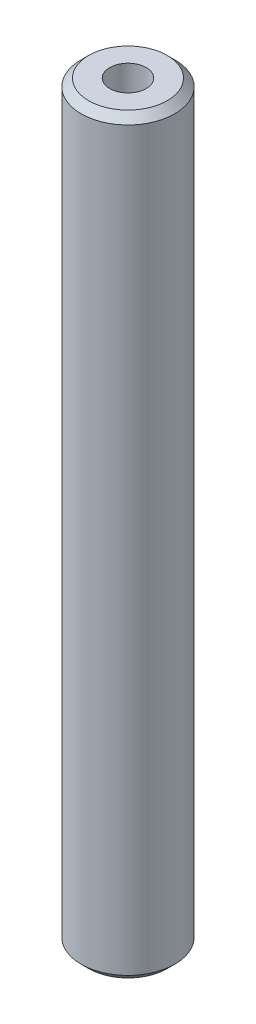
ISO-10303-21;
HEADER;
FILE_DESCRIPTION(('STEP AP214'),'2;1');
FILE_NAME('part.step','',(''),(''),'','','');
FILE_SCHEMA(('AUTOMOTIVE_DESIGN { 1 0 10303 214 1 1 1 1 }'));
ENDSEC;
DATA;
#1=APPLICATION_CONTEXT('core data for automotive mechanical design processes');
#2=APPLICATION_PROTOCOL_DEFINITION('international standard','automotive_design',2000,#1);
#3=PRODUCT_CONTEXT('',#1,'mechanical');
#4=PRODUCT('Part','Part','',(#3));
#5=PRODUCT_RELATED_PRODUCT_CATEGORY('part','',(#4));
#6=PRODUCT_DEFINITION_FORMATION('','',#4);
#7=PRODUCT_DEFINITION_CONTEXT('part definition',#1,'design');
#8=PRODUCT_DEFINITION('design','',#6,#7);
#9=PRODUCT_DEFINITION_SHAPE('','',#8);
#10=(LENGTH_UNIT() NAMED_UNIT(*) SI_UNIT(.MILLI.,.METRE.));
#11=(NAMED_UNIT(*) PLANE_ANGLE_UNIT() SI_UNIT($,.RADIAN.));
#12=(NAMED_UNIT(*) SI_UNIT($,.STERADIAN.) SOLID_ANGLE_UNIT());
#13=UNCERTAINTY_MEASURE_WITH_UNIT(LENGTH_MEASURE(1.E-05),#10,'distance_accuracy_value','');
#14=(GEOMETRIC_REPRESENTATION_CONTEXT(3) GLOBAL_UNCERTAINTY_ASSIGNED_CONTEXT((#13)) GLOBAL_UNIT_ASSIGNED_CONTEXT((#10,
#11,#12)) REPRESENTATION_CONTEXT('',''));
#15=CARTESIAN_POINT('',(0.,0.,0.));
#16=DIRECTION('',(0.,0.,1.));
#17=DIRECTION('',(1.,0.,0.));
#18=AXIS2_PLACEMENT_3D('',#15,#16,#17);
#19=CARTESIAN_POINT('',(0.,361.170907466975,0.));
#20=DIRECTION('',(0.,-1.,0.));
#21=DIRECTION('',(0.,0.,-1.));
#22=AXIS2_PLACEMENT_3D('',#19,#20,#21);
#23=CYLINDRICAL_SURFACE('',#22,22.5);
#24=CARTESIAN_POINT('',(0.,357.540232934624,0.));
#25=DIRECTION('',(0.,1.,0.));
#26=DIRECTION('',(0.,0.,1.));
#27=AXIS2_PLACEMENT_3D('',#24,#25,#26);
#28=CIRCLE('',#27,22.5);
#29=CARTESIAN_POINT('',(0.,357.540232934624,22.5));
#30=VERTEX_POINT('',#29);
#31=EDGE_CURVE('E50',#30,#30,#28,.F.);
#32=ORIENTED_EDGE('',*,*,#31,.T.);
#33=EDGE_LOOP('',(#32));
#34=FACE_BOUND('',#33,.T.);
#35=CARTESIAN_POINT('',(0.,3.63067453235028,0.));
#36=DIRECTION('',(0.,1.,0.));
#37=DIRECTION('',(0.,0.,1.));
#38=AXIS2_PLACEMENT_3D('',#35,#36,#37);
#39=CIRCLE('',#38,22.5);
#40=CARTESIAN_POINT('',(0.,3.63067453235028,22.5));
#41=VERTEX_POINT('',#40);
#42=EDGE_CURVE('E51',#41,#41,#39,.T.);
#43=ORIENTED_EDGE('',*,*,#42,.T.);
#44=EDGE_LOOP('',(#43));
#45=FACE_BOUND('',#44,.T.);
#46=ADVANCED_FACE('F39',(#34,#45),#23,.T.);
#47=CARTESIAN_POINT('',(0.,361.170907466975,0.));
#48=DIRECTION('',(0.,1.,0.));
#49=DIRECTION('',(0.,0.,1.));
#50=AXIS2_PLACEMENT_3D('',#47,#48,#49);
#51=PLANE('',#50);
#52=CARTESIAN_POINT('',(0.,361.170907466975,0.));
#53=DIRECTION('',(0.,1.,0.));
#54=DIRECTION('',(0.,0.,1.));
#55=AXIS2_PLACEMENT_3D('',#52,#53,#54);
#56=CIRCLE('',#55,18.8693254676497);
#57=CARTESIAN_POINT('',(0.,361.170907466975,18.8693254676497));
#58=VERTEX_POINT('',#57);
#59=EDGE_CURVE('E54',#58,#58,#56,.T.);
#60=ORIENTED_EDGE('',*,*,#59,.T.);
#61=EDGE_LOOP('',(#60));
#62=FACE_BOUND('',#61,.T.);
#63=CARTESIAN_POINT('',(0.,361.170907466975,0.));
#64=DIRECTION('',(0.,1.,0.));
#65=DIRECTION('',(0.,0.,1.));
#66=AXIS2_PLACEMENT_3D('',#63,#64,#65);
#67=CIRCLE('',#66,8.75318210047726);
#68=CARTESIAN_POINT('',(0.,361.170907466975,8.75318210047726));
#69=VERTEX_POINT('',#68);
#70=EDGE_CURVE('E58',#69,#69,#67,.T.);
#71=ORIENTED_EDGE('',*,*,#70,.F.);
#72=EDGE_LOOP('',(#71));
#73=FACE_BOUND('',#72,.T.);
#74=ADVANCED_FACE('F69',(#62,#73),#51,.T.);
#75=CARTESIAN_POINT('',(0.,0.,0.));
#76=DIRECTION('',(0.,1.,0.));
#77=DIRECTION('',(0.,0.,1.));
#78=AXIS2_PLACEMENT_3D('',#75,#76,#77);
#79=PLANE('',#78);
#80=CARTESIAN_POINT('',(0.,0.,0.));
#81=DIRECTION('',(0.,1.,0.));
#82=DIRECTION('',(0.,0.,1.));
#83=AXIS2_PLACEMENT_3D('',#80,#81,#82);
#84=CIRCLE('',#83,18.8693254676497);
#85=CARTESIAN_POINT('',(0.,0.,18.8693254676497));
#86=VERTEX_POINT('',#85);
#87=EDGE_CURVE('E10',#86,#86,#84,.F.);
#88=ORIENTED_EDGE('',*,*,#87,.T.);
#89=EDGE_LOOP('',(#88));
#90=FACE_BOUND('',#89,.T.);
#91=CARTESIAN_POINT('',(0.,0.,0.));
#92=DIRECTION('',(0.,1.,0.));
#93=DIRECTION('',(0.,0.,1.));
#94=AXIS2_PLACEMENT_3D('',#91,#92,#93);
#95=CIRCLE('',#94,8.75318210047726);
#96=CARTESIAN_POINT('',(0.,0.,8.75318210047726));
#97=VERTEX_POINT('',#96);
#98=EDGE_CURVE('E63',#97,#97,#95,.T.);
#99=ORIENTED_EDGE('',*,*,#98,.T.);
#100=EDGE_LOOP('',(#99));
#101=FACE_BOUND('',#100,.T.);
#102=ADVANCED_FACE('F75',(#90,#101),#79,.F.);
#103=CARTESIAN_POINT('',(0.,361.170907466975,0.));
#104=DIRECTION('',(0.,-1.,0.));
#105=DIRECTION('',(0.,0.,-1.));
#106=AXIS2_PLACEMENT_3D('',#103,#104,#105);
#107=CYLINDRICAL_SURFACE('',#106,8.75318210047726);
#108=ORIENTED_EDGE('',*,*,#70,.T.);
#109=EDGE_LOOP('',(#108));
#110=FACE_BOUND('',#109,.T.);
#111=ORIENTED_EDGE('',*,*,#98,.F.);
#112=EDGE_LOOP('',(#111));
#113=FACE_BOUND('',#112,.T.);
#114=ADVANCED_FACE('F70',(#110,#113),#107,.F.);
#115=CARTESIAN_POINT('',(0.,361.170907466975,0.));
#116=DIRECTION('',(0.,-1.,0.));
#117=DIRECTION('',(0.,0.,-1.));
#118=AXIS2_PLACEMENT_3D('',#115,#116,#117);
#119=CONICAL_SURFACE('',#118,18.8693254676497,0.785398163397438);
#120=ORIENTED_EDGE('',*,*,#31,.F.);
#121=EDGE_LOOP('',(#120));
#122=FACE_BOUND('',#121,.T.);
#123=ORIENTED_EDGE('',*,*,#59,.F.);
#124=EDGE_LOOP('',(#123));
#125=FACE_BOUND('',#124,.T.);
#126=ADVANCED_FACE('F81',(#122,#125),#119,.T.);
#127=CARTESIAN_POINT('',(0.,3.63067453235028,0.));
#128=DIRECTION('',(0.,1.,0.));
#129=DIRECTION('',(0.,0.,1.));
#130=AXIS2_PLACEMENT_3D('',#127,#128,#129);
#131=CONICAL_SURFACE('',#130,22.5,0.78539816339745);
#132=CARTESIAN_POINT('',(0.,0.,18.8693254676497));
#133=CARTESIAN_POINT('',(0.,0.0378195263786491,18.9071449940284));
#134=CARTESIAN_POINT('',(0.,0.0756390527572976,18.944964520407));
#135=CARTESIAN_POINT('',(0.,0.151278105514594,19.0206035731643));
#136=CARTESIAN_POINT('',(0.,0.189097631893243,19.058423099543));
#137=CARTESIAN_POINT('',(0.,0.26473668465054,19.1340621523003));
#138=CARTESIAN_POINT('',(0.,0.302556211029189,19.1718816786789));
#139=CARTESIAN_POINT('',(0.,0.378195263786487,19.2475207314362));
#140=CARTESIAN_POINT('',(0.,0.416014790165135,19.2853402578148));
#141=CARTESIAN_POINT('',(0.,0.491653842922432,19.3609793105721));
#142=CARTESIAN_POINT('',(0.,0.529473369301081,19.3987988369508));
#143=CARTESIAN_POINT('',(0.,0.605112422058379,19.4744378897081));
#144=CARTESIAN_POINT('',(0.,0.642931948437028,19.5122574160867));
#145=CARTESIAN_POINT('',(0.,0.718571001194325,19.587896468844));
#146=CARTESIAN_POINT('',(0.,0.756390527572974,19.6257159952227));
#147=CARTESIAN_POINT('',(0.,0.832029580330271,19.70135504798));
#148=CARTESIAN_POINT('',(0.,0.869849106708919,19.7391745743586));
#149=CARTESIAN_POINT('',(0.,0.945488159466217,19.8148136271159));
#150=CARTESIAN_POINT('',(0.,0.983307685844866,19.8526331534946));
#151=CARTESIAN_POINT('',(0.,1.05894673860216,19.9282722062519));
#152=CARTESIAN_POINT('',(0.,1.09676626498081,19.9660917326305));
#153=CARTESIAN_POINT('',(0.,1.17240531773811,20.0417307853878));
#154=CARTESIAN_POINT('',(0.,1.21022484411676,20.0795503117665));
#155=CARTESIAN_POINT('',(0.,1.28586389687406,20.1551893645238));
#156=CARTESIAN_POINT('',(0.,1.3236834232527,20.1930088909024));
#157=CARTESIAN_POINT('',(0.,1.39932247601,20.2686479436597));
#158=CARTESIAN_POINT('',(0.,1.43714200238865,20.3064674700384));
#159=CARTESIAN_POINT('',(0.,1.51278105514595,20.3821065227957));
#160=CARTESIAN_POINT('',(0.,1.5506005815246,20.4199260491743));
#161=CARTESIAN_POINT('',(0.,1.62623963428189,20.4955651019316));
#162=CARTESIAN_POINT('',(0.,1.66405916066054,20.5333846283103));
#163=CARTESIAN_POINT('',(0.,1.73969821341784,20.6090236810676));
#164=CARTESIAN_POINT('',(0.,1.77751773979649,20.6468432074462));
#165=CARTESIAN_POINT('',(0.,1.85315679255379,20.7224822602035));
#166=CARTESIAN_POINT('',(0.,1.89097631893244,20.7603017865822));
#167=CARTESIAN_POINT('',(0.,1.96661537168973,20.8359408393395));
#168=CARTESIAN_POINT('',(0.,2.00443489806838,20.8737603657181));
#169=CARTESIAN_POINT('',(0.,2.08007395082568,20.9493994184754));
#170=CARTESIAN_POINT('',(0.,2.11789347720433,20.987218944854));
#171=CARTESIAN_POINT('',(0.,2.19353252996162,21.0628579976113));
#172=CARTESIAN_POINT('',(0.,2.23135205634027,21.10067752399));
#173=CARTESIAN_POINT('',(0.,2.30699110909757,21.1763165767473));
#174=CARTESIAN_POINT('',(0.,2.34481063547622,21.2141361031259));
#175=CARTESIAN_POINT('',(0.,2.42044968823352,21.2897751558832));
#176=CARTESIAN_POINT('',(0.,2.45826921461216,21.3275946822619));
#177=CARTESIAN_POINT('',(0.,2.53390826736946,21.4032337350192));
#178=CARTESIAN_POINT('',(0.,2.57172779374811,21.4410532613978));
#179=CARTESIAN_POINT('',(0.,2.64736684650541,21.5166923141551));
#180=CARTESIAN_POINT('',(0.,2.68518637288406,21.5545118405338));
#181=CARTESIAN_POINT('',(0.,2.76082542564136,21.6301508932911));
#182=CARTESIAN_POINT('',(0.,2.79864495202,21.6679704196697));
#183=CARTESIAN_POINT('',(0.,2.8742840047773,21.743609472427));
#184=CARTESIAN_POINT('',(0.,2.91210353115595,21.7814289988057));
#185=CARTESIAN_POINT('',(0.,2.98774258391325,21.857068051563));
#186=CARTESIAN_POINT('',(0.,3.0255621102919,21.8948875779416));
#187=CARTESIAN_POINT('',(0.,3.10120116304919,21.9705266306989));
#188=CARTESIAN_POINT('',(0.,3.13902068942784,22.0083461570776));
#189=CARTESIAN_POINT('',(0.,3.21465974218514,22.0839852098349));
#190=CARTESIAN_POINT('',(0.,3.25247926856379,22.1218047362135));
#191=CARTESIAN_POINT('',(0.,3.32811832132109,22.1974437889708));
#192=CARTESIAN_POINT('',(0.,3.36593784769973,22.2352633153495));
#193=CARTESIAN_POINT('',(0.,3.44157690045703,22.3109023681068));
#194=CARTESIAN_POINT('',(0.,3.47939642683568,22.3487218944854));
#195=CARTESIAN_POINT('',(0.,3.55503547959298,22.4243609472427));
#196=CARTESIAN_POINT('',(0.,3.59285500597163,22.4621804736214));
#197=CARTESIAN_POINT('',(0.,3.63067453235028,22.5));
#198=B_SPLINE_CURVE_WITH_KNOTS('',3,(#132,#133,#134,#135,#136,#137,#138,#139,#140,#141,#142,
#143,#144,#145,#146,#147,#148,#149,#150,#151,#152,#153,#154,#155,#156,#157,#158,#159,#160,#161,
#162,#163,#164,#165,#166,#167,#168,#169,#170,#171,#172,#173,#174,#175,#176,#177,#178,#179,#180,
#181,#182,#183,#184,#185,#186,#187,#188,#189,#190,#191,#192,#193,#194,#195,#196,#197),
.UNSPECIFIED.,.F.,.F.,(4,2,2,2,2,2,2,2,2,2,2,2,2,2,2,2,2,2,2,2,2,2,2,2,2,2,2,2,2,2,2,2,4),(0.,
0.160454661381635,0.320909322763272,0.481363984144907,0.641818645526544,0.802273306908182,
0.962727968289816,1.12318262967145,1.28363729105309,1.44409195243473,1.60454661381636,
1.765001275198,1.92545593657964,2.08591059796127,2.24636525934291,2.40681992072455,
2.56727458210618,2.72772924348782,2.88818390486946,3.04863856625109,3.20909322763273,
3.36954788901436,3.530002550396,3.69045721177764,3.85091187315927,4.01136653454091,
4.17182119592255,4.33227585730418,4.49273051868582,4.65318518006746,4.81363984144909,
4.97409450283073,5.13454916421236),.UNSPECIFIED.);
#199=EDGE_CURVE('BSEAM45',#86,#41,#198,.T.);
#200=ORIENTED_EDGE('',*,*,#87,.F.);
#201=ORIENTED_EDGE('',*,*,#42,.F.);
#202=ORIENTED_EDGE('',*,*,#199,.T.);
#203=ORIENTED_EDGE('',*,*,#199,.F.);
#204=EDGE_LOOP('',(#200,#202,#201,#203));
#205=FACE_BOUND('',#204,.T.);
#206=ADVANCED_FACE('F45',(#205),#131,.T.);
#207=CLOSED_SHELL('',(#46,#74,#102,#114,#126,#206));
#208=MANIFOLD_SOLID_BREP('B2',#207);
#209=ADVANCED_BREP_SHAPE_REPRESENTATION('',(#18,#208),#14);
#210=SHAPE_DEFINITION_REPRESENTATION(#9,#209);
ENDSEC;
END-ISO-10303-21;
